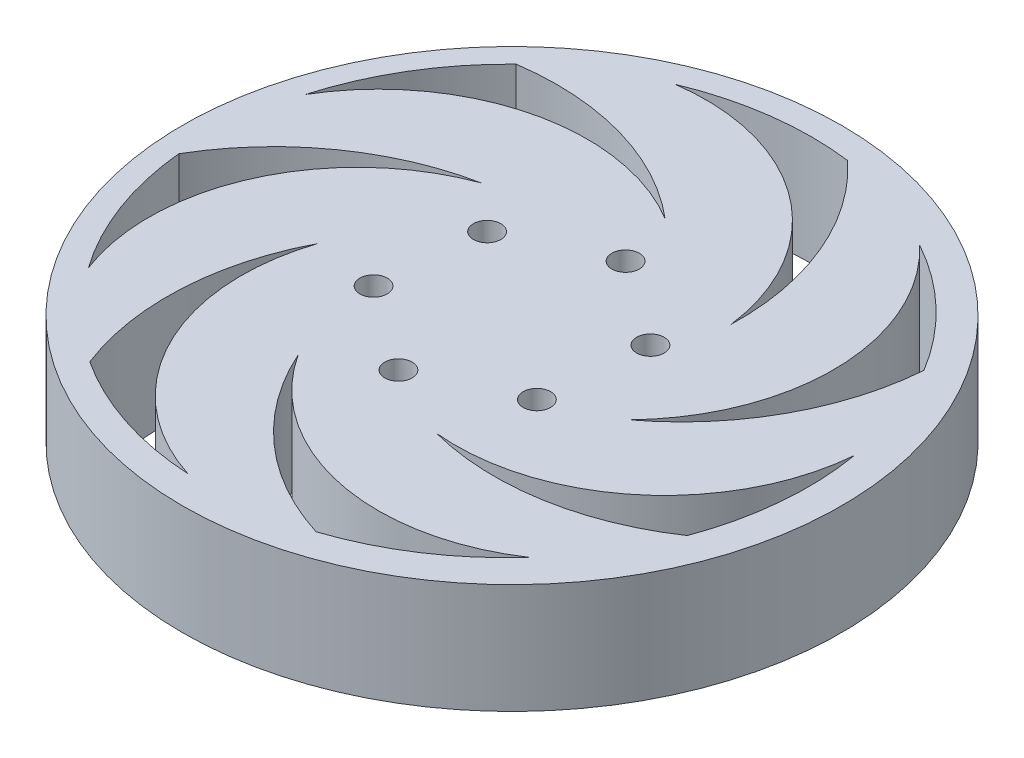
ISO-10303-21;
HEADER;
FILE_DESCRIPTION(('STEP AP214'),'2;1');
FILE_NAME('part.step','',(''),(''),'','','');
FILE_SCHEMA(('AUTOMOTIVE_DESIGN { 1 0 10303 214 1 1 1 1 }'));
ENDSEC;
DATA;
#1=APPLICATION_CONTEXT('core data for automotive mechanical design processes');
#2=APPLICATION_PROTOCOL_DEFINITION('international standard','automotive_design',2000,#1);
#3=PRODUCT_CONTEXT('',#1,'mechanical');
#4=PRODUCT('Part','Part','',(#3));
#5=PRODUCT_RELATED_PRODUCT_CATEGORY('part','',(#4));
#6=PRODUCT_DEFINITION_FORMATION('','',#4);
#7=PRODUCT_DEFINITION_CONTEXT('part definition',#1,'design');
#8=PRODUCT_DEFINITION('design','',#6,#7);
#9=PRODUCT_DEFINITION_SHAPE('','',#8);
#10=(LENGTH_UNIT() NAMED_UNIT(*) SI_UNIT(.MILLI.,.METRE.));
#11=(NAMED_UNIT(*) PLANE_ANGLE_UNIT() SI_UNIT($,.RADIAN.));
#12=(NAMED_UNIT(*) SI_UNIT($,.STERADIAN.) SOLID_ANGLE_UNIT());
#13=UNCERTAINTY_MEASURE_WITH_UNIT(LENGTH_MEASURE(1.E-05),#10,'distance_accuracy_value','');
#14=(GEOMETRIC_REPRESENTATION_CONTEXT(3) GLOBAL_UNCERTAINTY_ASSIGNED_CONTEXT((#13)) GLOBAL_UNIT_ASSIGNED_CONTEXT((#10,
#11,#12)) REPRESENTATION_CONTEXT('',''));
#15=CARTESIAN_POINT('',(0.,0.,0.));
#16=DIRECTION('',(0.,0.,1.));
#17=DIRECTION('',(1.,0.,0.));
#18=AXIS2_PLACEMENT_3D('',#15,#16,#17);
#19=CARTESIAN_POINT('',(0.,10.,0.));
#20=DIRECTION('',(0.,1.,0.));
#21=DIRECTION('',(0.,0.,1.));
#22=AXIS2_PLACEMENT_3D('',#19,#20,#21);
#23=PLANE('',#22);
#24=CARTESIAN_POINT('',(-8.63037772245772,10.,3.97071534710085));
#25=DIRECTION('',(0.,1.,0.));
#26=DIRECTION('',(0.,0.,1.));
#27=AXIS2_PLACEMENT_3D('',#24,#25,#26);
#28=CIRCLE('',#27,1.25000000000002);
#29=CARTESIAN_POINT('',(-8.63037772245772,10.,5.22071534710087));
#30=VERTEX_POINT('',#29);
#31=EDGE_CURVE('E449',#30,#30,#28,.T.);
#32=ORIENTED_EDGE('',*,*,#31,.F.);
#33=EDGE_LOOP('',(#32));
#34=FACE_BOUND('',#33,.T.);
#35=CARTESIAN_POINT('',(0.876448499442818,10.,-9.45948402545444));
#36=DIRECTION('',(0.,1.,0.));
#37=DIRECTION('',(0.,0.,1.));
#38=AXIS2_PLACEMENT_3D('',#35,#36,#37);
#39=CIRCLE('',#38,1.25);
#40=CARTESIAN_POINT('',(0.876448499442818,10.,-8.20948402545444));
#41=VERTEX_POINT('',#40);
#42=EDGE_CURVE('E441',#41,#41,#39,.T.);
#43=ORIENTED_EDGE('',*,*,#42,.F.);
#44=EDGE_LOOP('',(#43));
#45=FACE_BOUND('',#44,.T.);
#46=CARTESIAN_POINT('',(8.63037772245795,10.,-3.97071534710117));
#47=DIRECTION('',(0.,1.,0.));
#48=DIRECTION('',(0.,0.,1.));
#49=AXIS2_PLACEMENT_3D('',#46,#47,#48);
#50=CIRCLE('',#49,1.25);
#51=CARTESIAN_POINT('',(8.63037772245795,10.,-2.72071534710117));
#52=VERTEX_POINT('',#51);
#53=EDGE_CURVE('E433',#52,#52,#50,.T.);
#54=ORIENTED_EDGE('',*,*,#53,.F.);
#55=EDGE_LOOP('',(#54));
#56=FACE_BOUND('',#55,.T.);
#57=CARTESIAN_POINT('',(7.75392922301525,10.,5.48876867835311));
#58=DIRECTION('',(0.,1.,0.));
#59=DIRECTION('',(0.,0.,1.));
#60=AXIS2_PLACEMENT_3D('',#57,#58,#59);
#61=CIRCLE('',#60,1.25);
#62=CARTESIAN_POINT('',(7.75392922301525,10.,6.7387686783531));
#63=VERTEX_POINT('',#62);
#64=EDGE_CURVE('E424',#63,#63,#61,.T.);
#65=ORIENTED_EDGE('',*,*,#64,.F.);
#66=EDGE_LOOP('',(#65));
#67=FACE_BOUND('',#66,.T.);
#68=CARTESIAN_POINT('',(-0.876448499442583,10.,9.45948402545411));
#69=DIRECTION('',(0.,1.,0.));
#70=DIRECTION('',(0.,0.,1.));
#71=AXIS2_PLACEMENT_3D('',#68,#69,#70);
#72=CIRCLE('',#71,1.25);
#73=CARTESIAN_POINT('',(-0.876448499442583,10.,10.7094840254541));
#74=VERTEX_POINT('',#73);
#75=EDGE_CURVE('E423',#74,#74,#72,.T.);
#76=ORIENTED_EDGE('',*,*,#75,.F.);
#77=EDGE_LOOP('',(#76));
#78=FACE_BOUND('',#77,.T.);
#79=CARTESIAN_POINT('',(-7.75392922301502,10.,-5.48876867835344));
#80=DIRECTION('',(0.,1.,0.));
#81=DIRECTION('',(0.,0.,1.));
#82=AXIS2_PLACEMENT_3D('',#79,#80,#81);
#83=CIRCLE('',#82,1.25);
#84=CARTESIAN_POINT('',(-7.75392922301502,10.,-4.23876867835344));
#85=VERTEX_POINT('',#84);
#86=EDGE_CURVE('E428',#85,#85,#83,.T.);
#87=ORIENTED_EDGE('',*,*,#86,.F.);
#88=EDGE_LOOP('',(#87));
#89=FACE_BOUND('',#88,.T.);
#90=CARTESIAN_POINT('',(0.,10.,0.));
#91=DIRECTION('',(0.,1.,0.));
#92=DIRECTION('',(0.,0.,1.));
#93=AXIS2_PLACEMENT_3D('',#90,#91,#92);
#94=CIRCLE('',#93,30.);
#95=CARTESIAN_POINT('',(0.,10.,30.));
#96=VERTEX_POINT('',#95);
#97=EDGE_CURVE('E11',#96,#96,#94,.T.);
#98=ORIENTED_EDGE('',*,*,#97,.T.);
#99=EDGE_LOOP('',(#98));
#100=FACE_BOUND('',#99,.T.);
#101=CARTESIAN_POINT('',(0.,10.,0.));
#102=DIRECTION('',(0.,1.,0.));
#103=DIRECTION('',(0.,0.,1.));
#104=AXIS2_PLACEMENT_3D('',#101,#102,#103);
#105=CIRCLE('',#104,27.);
#106=CARTESIAN_POINT('',(25.3240627069362,10.,9.36439255986001));
#107=VERTEX_POINT('',#106);
#108=CARTESIAN_POINT('',(26.6134779111669,10.,-4.55222950561939));
#109=VERTEX_POINT('',#108);
#110=EDGE_CURVE('E402',#107,#109,#105,.T.);
#111=ORIENTED_EDGE('',*,*,#110,.F.);
#112=CARTESIAN_POINT('',(11.8750939685419,10.,-10.5133648557463));
#113=DIRECTION('',(0.,1.,0.));
#114=DIRECTION('',(0.,0.,1.));
#115=AXIS2_PLACEMENT_3D('',#112,#113,#114);
#116=CIRCLE('',#115,24.);
#117=CARTESIAN_POINT('',(5.85158051151755,10.,12.7184513804641));
#118=VERTEX_POINT('',#117);
#119=EDGE_CURVE('E379',#107,#118,#116,.F.);
#120=ORIENTED_EDGE('',*,*,#119,.T.);
#121=CARTESIAN_POINT('',(7.68445044317262,10.,-6.1929364008077));
#122=DIRECTION('',(0.,1.,0.));
#123=DIRECTION('',(0.,0.,1.));
#124=AXIS2_PLACEMENT_3D('',#121,#122,#123);
#125=CIRCLE('',#124,19.);
#126=EDGE_CURVE('E390',#109,#118,#125,.F.);
#127=ORIENTED_EDGE('',*,*,#126,.F.);
#128=EDGE_LOOP('',(#111,#120,#127));
#129=FACE_BOUND('',#128,.T.);
#130=CARTESIAN_POINT('',(-0.0408638305729063,10.,-0.468279757238414));
#131=DIRECTION('',(0.,1.,0.));
#132=DIRECTION('',(0.781831482468031,0.,0.623489801858732));
#133=AXIS2_PLACEMENT_3D('',#130,#131,#132);
#134=CIRCLE('',#133,27.);
#135=CARTESIAN_POINT('',(23.0698079263208,10.,-14.4288259838412));
#136=VERTEX_POINT('',#135);
#137=CARTESIAN_POINT('',(12.9932918961192,10.,-24.1138033186303));
#138=VERTEX_POINT('',#137);
#139=EDGE_CURVE('E369',#136,#138,#134,.T.);
#140=ORIENTED_EDGE('',*,*,#139,.F.);
#141=CARTESIAN_POINT('',(-0.856543475968335,10.,-16.3075778498885));
#142=DIRECTION('',(0.,1.,0.));
#143=DIRECTION('',(0.781831482468031,0.,0.623489801858732));
#144=AXIS2_PLACEMENT_3D('',#141,#142,#143);
#145=CIRCLE('',#144,24.);
#146=CARTESIAN_POINT('',(13.5512226405994,10.,2.88659510781623));
#147=VERTEX_POINT('',#146);
#148=EDGE_CURVE('E346',#136,#147,#145,.F.);
#149=ORIENTED_EDGE('',*,*,#148,.T.);
#150=CARTESIAN_POINT('',(-0.0915199934396815,10.,-10.3374577286395));
#151=DIRECTION('',(0.,1.,0.));
#152=DIRECTION('',(0.781831482468031,0.,0.623489801858732));
#153=AXIS2_PLACEMENT_3D('',#150,#151,#152);
#154=CIRCLE('',#153,19.);
#155=EDGE_CURVE('E357',#138,#147,#154,.F.);
#156=ORIENTED_EDGE('',*,*,#155,.F.);
#157=EDGE_LOOP('',(#140,#149,#156));
#158=FACE_BOUND('',#157,.T.);
#159=CARTESIAN_POINT('',(-0.340637675184382,10.,0.323916282291169));
#160=DIRECTION('',(0.,1.,0.));
#161=DIRECTION('',(-0.781831482468022,0.,0.623489801858743));
#162=AXIS2_PLACEMENT_3D('',#159,#160,#161);
#163=CIRCLE('',#162,27.);
#164=CARTESIAN_POINT('',(8.12728024673381,10.,25.9616690322429));
#165=VERTEX_POINT('',#164);
#166=CARTESIAN_POINT('',(19.8116707373342,10.,18.2929024987346));
#167=VERTEX_POINT('',#166);
#168=EDGE_CURVE('E212',#165,#167,#163,.T.);
#169=ORIENTED_EDGE('',*,*,#168,.F.);
#170=CARTESIAN_POINT('',(15.2830419412111,10.,3.0532628333854));
#171=DIRECTION('',(0.,1.,0.));
#172=DIRECTION('',(-0.781831482468022,0.,0.623489801858743));
#173=AXIS2_PLACEMENT_3D('',#170,#171,#172);
#174=CIRCLE('',#173,24.);
#175=CARTESIAN_POINT('',(-6.6359225989835,10.,12.8286908795475));
#176=VERTEX_POINT('',#175);
#177=EDGE_CURVE('E189',#165,#176,#174,.F.);
#178=ORIENTED_EDGE('',*,*,#177,.T.);
#179=CARTESIAN_POINT('',(9.29237145609631,10.,2.47062887476548));
#180=DIRECTION('',(0.,1.,0.));
#181=DIRECTION('',(-0.781831482468022,0.,0.623489801858743));
#182=AXIS2_PLACEMENT_3D('',#179,#180,#181);
#183=CIRCLE('',#182,19.);
#184=EDGE_CURVE('E208',#167,#176,#183,.F.);
#185=ORIENTED_EDGE('',*,*,#184,.F.);
#186=EDGE_LOOP('',(#169,#178,#185));
#187=FACE_BOUND('',#186,.T.);
#188=CARTESIAN_POINT('',(-0.879903817308818,10.,-0.584257443099585));
#189=DIRECTION('',(0.,1.,0.));
#190=DIRECTION('',(0.433883739117553,0.,-0.900968867902422));
#191=AXIS2_PLACEMENT_3D('',#188,#189,#190);
#192=CIRCLE('',#191,27.);
#193=CARTESIAN_POINT('',(-19.6330382666304,10.,-20.0089826232834));
#194=VERTEX_POINT('',#193);
#195=CARTESIAN_POINT('',(-26.8329572410984,10.,-8.02999568600916));
#196=VERTEX_POINT('',#195);
#197=EDGE_CURVE('E303',#194,#196,#192,.T.);
#198=ORIENTED_EDGE('',*,*,#197,.F.);
#199=CARTESIAN_POINT('',(-16.1405718406991,10.,3.73554681538402));
#200=DIRECTION('',(0.,1.,0.));
#201=DIRECTION('',(0.433883739117553,0.,-0.900968867902422));
#202=AXIS2_PLACEMENT_3D('',#199,#200,#201);
#203=CIRCLE('',#202,24.);
#204=CARTESIAN_POINT('',(-0.633666445470114,10.,-14.5820918169129));
#205=VERTEX_POINT('',#204);
#206=EDGE_CURVE('E281',#194,#205,#203,.F.);
#207=ORIENTED_EDGE('',*,*,#206,.T.);
#208=CARTESIAN_POINT('',(-10.490368835246,10.,1.66122736358056));
#209=DIRECTION('',(0.,1.,0.));
#210=DIRECTION('',(0.433883739117553,0.,-0.900968867902422));
#211=AXIS2_PLACEMENT_3D('',#208,#209,#210);
#212=CIRCLE('',#211,19.);
#213=EDGE_CURVE('E291',#196,#205,#212,.F.);
#214=ORIENTED_EDGE('',*,*,#213,.F.);
#215=EDGE_LOOP('',(#198,#207,#214));
#216=FACE_BOUND('',#215,.T.);
#217=CARTESIAN_POINT('',(-0.432457869011476,10.,-0.728298781057311));
#218=DIRECTION('',(0.,1.,0.));
#219=DIRECTION('',(0.974927912181823,0.,-0.222520933956318));
#220=AXIS2_PLACEMENT_3D('',#217,#218,#219);
#221=CIRCLE('',#220,27.);
#222=CARTESIAN_POINT('',(3.06201573310802,10.,-27.5012077422459));
#223=VERTEX_POINT('',#222);
#224=CARTESIAN_POINT('',(-10.7926094373162,10.,-25.6615548757144));
#225=VERTEX_POINT('',#224);
#226=EDGE_CURVE('E336',#223,#225,#221,.T.);
#227=ORIENTED_EDGE('',*,*,#226,.F.);
#228=CARTESIAN_POINT('',(-13.3246877185289,10.,-9.9662155840466));
#229=DIRECTION('',(0.,1.,0.));
#230=DIRECTION('',(0.974927912181823,0.,-0.222520933956318));
#231=AXIS2_PLACEMENT_3D('',#228,#229,#230);
#232=CIRCLE('',#231,24.);
#233=CARTESIAN_POINT('',(10.6650162209869,10.,-9.26328963177384));
#234=VERTEX_POINT('',#233);
#235=EDGE_CURVE('E313',#223,#234,#232,.F.);
#236=ORIENTED_EDGE('',*,*,#235,.T.);
#237=CARTESIAN_POINT('',(-8.18007551408156,10.,-6.84202601604447));
#238=DIRECTION('',(0.,1.,0.));
#239=DIRECTION('',(0.974927912181823,0.,-0.222520933956318));
#240=AXIS2_PLACEMENT_3D('',#237,#238,#239);
#241=CIRCLE('',#240,19.);
#242=EDGE_CURVE('E324',#225,#234,#241,.F.);
#243=ORIENTED_EDGE('',*,*,#242,.F.);
#244=EDGE_LOOP('',(#227,#236,#243));
#245=FACE_BOUND('',#244,.T.);
#246=CARTESIAN_POINT('',(-0.806269738969957,10.,0.259553522381841));
#247=DIRECTION('',(0.,1.,0.));
#248=DIRECTION('',(-0.974927912181826,0.,-0.222520933956305));
#249=AXIS2_PLACEMENT_3D('',#246,#247,#248);
#250=CIRCLE('',#249,27.);
#251=CARTESIAN_POINT('',(-15.5710115113208,10.,22.8649157268633));
#252=VERTEX_POINT('',#251);
#253=CARTESIAN_POINT('',(-2.29023009190229,10.,27.2187423393868));
#254=VERTEX_POINT('',#253);
#255=EDGE_CURVE('E241',#252,#254,#250,.T.);
#256=ORIENTED_EDGE('',*,*,#255,.F.);
#257=CARTESIAN_POINT('',(6.80104610914974,10.,14.1763578588194));
#258=DIRECTION('',(0.,1.,0.));
#259=DIRECTION('',(-0.974927912181826,0.,-0.222520933956305));
#260=AXIS2_PLACEMENT_3D('',#257,#258,#259);
#261=CIRCLE('',#260,24.);
#262=CARTESIAN_POINT('',(-14.5079421500552,10.,3.13430101378079));
#263=VERTEX_POINT('',#262);
#264=EDGE_CURVE('E63',#252,#263,#261,.F.);
#265=ORIENTED_EDGE('',*,*,#264,.T.);
#266=CARTESIAN_POINT('',(3.52144572698861,10.,9.12939674104856));
#267=DIRECTION('',(0.,1.,0.));
#268=DIRECTION('',(-0.974927912181826,0.,-0.222520933956305));
#269=AXIS2_PLACEMENT_3D('',#266,#267,#268);
#270=CIRCLE('',#269,19.);
#271=EDGE_CURVE('E230',#254,#263,#270,.F.);
#272=ORIENTED_EDGE('',*,*,#271,.F.);
#273=EDGE_LOOP('',(#256,#265,#272));
#274=FACE_BOUND('',#273,.T.);
#275=CARTESIAN_POINT('',(-1.04626575016305,10.,-0.144621808755232));
#276=DIRECTION('',(0.,1.,0.));
#277=DIRECTION('',(-0.433883739117565,0.,-0.900968867902416));
#278=AXIS2_PLACEMENT_3D('',#275,#276,#277);
#279=CIRCLE('',#278,27.);
#280=CARTESIAN_POINT('',(-27.9255155163579,10.,2.40605104492707));
#281=VERTEX_POINT('',#280);
#282=CARTESIAN_POINT('',(-23.0490424555136,10.,15.5039505623745));
#283=VERTEX_POINT('',#282);
#284=EDGE_CURVE('E271',#281,#283,#279,.T.);
#285=ORIENTED_EDGE('',*,*,#284,.F.);
#286=CARTESIAN_POINT('',(-7.18377766491662,10.,14.4800027966149));
#287=DIRECTION('',(0.,1.,0.));
#288=DIRECTION('',(-0.433883739117565,0.,-0.900968867902416));
#289=AXIS2_PLACEMENT_3D('',#286,#287,#288);
#290=CIRCLE('',#289,24.);
#291=CARTESIAN_POINT('',(-11.8366868598056,10.,-9.06464491839914));
#292=VERTEX_POINT('',#291);
#293=EDGE_CURVE('E55',#281,#292,#290,.F.);
#294=ORIENTED_EDGE('',*,*,#293,.T.);
#295=CARTESIAN_POINT('',(-5.28270196470079,10.,8.76917918061951));
#296=DIRECTION('',(0.,1.,0.));
#297=DIRECTION('',(-0.433883739117565,0.,-0.900968867902416));
#298=AXIS2_PLACEMENT_3D('',#295,#296,#297);
#299=CIRCLE('',#298,19.);
#300=EDGE_CURVE('E260',#283,#292,#299,.F.);
#301=ORIENTED_EDGE('',*,*,#300,.F.);
#302=EDGE_LOOP('',(#285,#294,#301));
#303=FACE_BOUND('',#302,.T.);
#304=ADVANCED_FACE('F39',(#34,#45,#56,#67,#78,#89,#100,#129,#158,#187,#216,#245,#274,#303),#23,.T.);
#305=CARTESIAN_POINT('',(0.,0.,0.));
#306=DIRECTION('',(0.,1.,0.));
#307=DIRECTION('',(0.,0.,1.));
#308=AXIS2_PLACEMENT_3D('',#305,#306,#307);
#309=PLANE('',#308);
#310=CARTESIAN_POINT('',(6.80104610914974,0.,14.1763578588194));
#311=DIRECTION('',(0.,1.,0.));
#312=DIRECTION('',(-0.974927912181826,0.,-0.222520933956305));
#313=AXIS2_PLACEMENT_3D('',#310,#311,#312);
#314=CIRCLE('',#313,24.);
#315=CARTESIAN_POINT('',(-15.5710115113208,0.,22.8649157268633));
#316=VERTEX_POINT('',#315);
#317=CARTESIAN_POINT('',(-14.5079421500552,0.,3.13430101378079));
#318=VERTEX_POINT('',#317);
#319=EDGE_CURVE('E226',#316,#318,#314,.F.);
#320=ORIENTED_EDGE('',*,*,#319,.F.);
#321=CARTESIAN_POINT('',(-0.806269738969957,0.,0.259553522381841));
#322=DIRECTION('',(0.,1.,0.));
#323=DIRECTION('',(-0.974927912181826,0.,-0.222520933956305));
#324=AXIS2_PLACEMENT_3D('',#321,#322,#323);
#325=CIRCLE('',#324,27.);
#326=CARTESIAN_POINT('',(-2.29023009190229,0.,27.2187423393868));
#327=VERTEX_POINT('',#326);
#328=EDGE_CURVE('E229',#316,#327,#325,.T.);
#329=ORIENTED_EDGE('',*,*,#328,.T.);
#330=CARTESIAN_POINT('',(3.52144572698861,0.,9.12939674104856));
#331=DIRECTION('',(0.,1.,0.));
#332=DIRECTION('',(-0.974927912181826,0.,-0.222520933956305));
#333=AXIS2_PLACEMENT_3D('',#330,#331,#332);
#334=CIRCLE('',#333,19.);
#335=EDGE_CURVE('E234',#327,#318,#334,.F.);
#336=ORIENTED_EDGE('',*,*,#335,.T.);
#337=EDGE_LOOP('',(#320,#329,#336));
#338=FACE_BOUND('',#337,.T.);
#339=CARTESIAN_POINT('',(-16.1405718406991,0.,3.73554681538402));
#340=DIRECTION('',(0.,1.,0.));
#341=DIRECTION('',(0.433883739117553,0.,-0.900968867902422));
#342=AXIS2_PLACEMENT_3D('',#339,#340,#341);
#343=CIRCLE('',#342,24.);
#344=CARTESIAN_POINT('',(-19.6330382666304,0.,-20.0089826232834));
#345=VERTEX_POINT('',#344);
#346=CARTESIAN_POINT('',(-0.633666445470114,0.,-14.5820918169129));
#347=VERTEX_POINT('',#346);
#348=EDGE_CURVE('E287',#345,#347,#343,.F.);
#349=ORIENTED_EDGE('',*,*,#348,.F.);
#350=CARTESIAN_POINT('',(-0.879903817308818,0.,-0.584257443099585));
#351=DIRECTION('',(0.,1.,0.));
#352=DIRECTION('',(0.433883739117553,0.,-0.900968867902422));
#353=AXIS2_PLACEMENT_3D('',#350,#351,#352);
#354=CIRCLE('',#353,27.);
#355=CARTESIAN_POINT('',(-26.8329572410984,0.,-8.02999568600916));
#356=VERTEX_POINT('',#355);
#357=EDGE_CURVE('E290',#345,#356,#354,.T.);
#358=ORIENTED_EDGE('',*,*,#357,.T.);
#359=CARTESIAN_POINT('',(-10.490368835246,0.,1.66122736358056));
#360=DIRECTION('',(0.,1.,0.));
#361=DIRECTION('',(0.433883739117553,0.,-0.900968867902422));
#362=AXIS2_PLACEMENT_3D('',#359,#360,#361);
#363=CIRCLE('',#362,19.);
#364=EDGE_CURVE('E295',#356,#347,#363,.F.);
#365=ORIENTED_EDGE('',*,*,#364,.T.);
#366=EDGE_LOOP('',(#349,#358,#365));
#367=FACE_BOUND('',#366,.T.);
#368=CARTESIAN_POINT('',(-0.856543475968335,0.,-16.3075778498885));
#369=DIRECTION('',(0.,1.,0.));
#370=DIRECTION('',(0.781831482468031,0.,0.623489801858732));
#371=AXIS2_PLACEMENT_3D('',#368,#369,#370);
#372=CIRCLE('',#371,24.);
#373=CARTESIAN_POINT('',(23.0698079263208,0.,-14.4288259838412));
#374=VERTEX_POINT('',#373);
#375=CARTESIAN_POINT('',(13.5512226405994,0.,2.88659510781623));
#376=VERTEX_POINT('',#375);
#377=EDGE_CURVE('E353',#374,#376,#372,.F.);
#378=ORIENTED_EDGE('',*,*,#377,.F.);
#379=CARTESIAN_POINT('',(-0.0408638305729063,0.,-0.468279757238414));
#380=DIRECTION('',(0.,1.,0.));
#381=DIRECTION('',(0.781831482468031,0.,0.623489801858732));
#382=AXIS2_PLACEMENT_3D('',#379,#380,#381);
#383=CIRCLE('',#382,27.);
#384=CARTESIAN_POINT('',(12.9932918961192,0.,-24.1138033186303));
#385=VERTEX_POINT('',#384);
#386=EDGE_CURVE('E356',#374,#385,#383,.T.);
#387=ORIENTED_EDGE('',*,*,#386,.T.);
#388=CARTESIAN_POINT('',(-0.0915199934396815,0.,-10.3374577286395));
#389=DIRECTION('',(0.,1.,0.));
#390=DIRECTION('',(0.781831482468031,0.,0.623489801858732));
#391=AXIS2_PLACEMENT_3D('',#388,#389,#390);
#392=CIRCLE('',#391,19.);
#393=EDGE_CURVE('E361',#385,#376,#392,.F.);
#394=ORIENTED_EDGE('',*,*,#393,.T.);
#395=EDGE_LOOP('',(#378,#387,#394));
#396=FACE_BOUND('',#395,.T.);
#397=CARTESIAN_POINT('',(0.,0.,0.));
#398=DIRECTION('',(0.,1.,0.));
#399=DIRECTION('',(0.,0.,1.));
#400=AXIS2_PLACEMENT_3D('',#397,#398,#399);
#401=CIRCLE('',#400,30.);
#402=CARTESIAN_POINT('',(0.,0.,30.));
#403=VERTEX_POINT('',#402);
#404=EDGE_CURVE('E43',#403,#403,#401,.T.);
#405=ORIENTED_EDGE('',*,*,#404,.F.);
#406=EDGE_LOOP('',(#405));
#407=FACE_BOUND('',#406,.T.);
#408=CARTESIAN_POINT('',(-7.75392922301502,0.,-5.48876867835344));
#409=DIRECTION('',(0.,1.,0.));
#410=DIRECTION('',(0.,0.,1.));
#411=AXIS2_PLACEMENT_3D('',#408,#409,#410);
#412=CIRCLE('',#411,1.25);
#413=CARTESIAN_POINT('',(-7.75392922301502,0.,-4.23876867835344));
#414=VERTEX_POINT('',#413);
#415=EDGE_CURVE('E462',#414,#414,#412,.F.);
#416=ORIENTED_EDGE('',*,*,#415,.F.);
#417=EDGE_LOOP('',(#416));
#418=FACE_BOUND('',#417,.T.);
#419=CARTESIAN_POINT('',(-0.876448499442583,0.,9.45948402545411));
#420=DIRECTION('',(0.,1.,0.));
#421=DIRECTION('',(0.,0.,1.));
#422=AXIS2_PLACEMENT_3D('',#419,#420,#421);
#423=CIRCLE('',#422,1.25);
#424=CARTESIAN_POINT('',(-0.876448499442583,0.,10.7094840254541));
#425=VERTEX_POINT('',#424);
#426=EDGE_CURVE('E419',#425,#425,#423,.F.);
#427=ORIENTED_EDGE('',*,*,#426,.F.);
#428=EDGE_LOOP('',(#427));
#429=FACE_BOUND('',#428,.T.);
#430=CARTESIAN_POINT('',(7.75392922301525,0.,5.48876867835311));
#431=DIRECTION('',(0.,1.,0.));
#432=DIRECTION('',(0.,0.,1.));
#433=AXIS2_PLACEMENT_3D('',#430,#431,#432);
#434=CIRCLE('',#433,1.25);
#435=CARTESIAN_POINT('',(7.75392922301525,0.,6.7387686783531));
#436=VERTEX_POINT('',#435);
#437=EDGE_CURVE('E429',#436,#436,#434,.F.);
#438=ORIENTED_EDGE('',*,*,#437,.F.);
#439=EDGE_LOOP('',(#438));
#440=FACE_BOUND('',#439,.T.);
#441=CARTESIAN_POINT('',(8.63037772245795,0.,-3.97071534710117));
#442=DIRECTION('',(0.,1.,0.));
#443=DIRECTION('',(0.,0.,1.));
#444=AXIS2_PLACEMENT_3D('',#441,#442,#443);
#445=CIRCLE('',#444,1.25);
#446=CARTESIAN_POINT('',(8.63037772245795,0.,-2.72071534710117));
#447=VERTEX_POINT('',#446);
#448=EDGE_CURVE('E437',#447,#447,#445,.F.);
#449=ORIENTED_EDGE('',*,*,#448,.F.);
#450=EDGE_LOOP('',(#449));
#451=FACE_BOUND('',#450,.T.);
#452=CARTESIAN_POINT('',(0.876448499442818,0.,-9.45948402545444));
#453=DIRECTION('',(0.,1.,0.));
#454=DIRECTION('',(0.,0.,1.));
#455=AXIS2_PLACEMENT_3D('',#452,#453,#454);
#456=CIRCLE('',#455,1.25);
#457=CARTESIAN_POINT('',(0.876448499442818,0.,-8.20948402545444));
#458=VERTEX_POINT('',#457);
#459=EDGE_CURVE('E445',#458,#458,#456,.F.);
#460=ORIENTED_EDGE('',*,*,#459,.F.);
#461=EDGE_LOOP('',(#460));
#462=FACE_BOUND('',#461,.T.);
#463=CARTESIAN_POINT('',(-8.63037772245772,0.,3.97071534710085));
#464=DIRECTION('',(0.,1.,0.));
#465=DIRECTION('',(0.,0.,1.));
#466=AXIS2_PLACEMENT_3D('',#463,#464,#465);
#467=CIRCLE('',#466,1.25000000000002);
#468=CARTESIAN_POINT('',(-8.63037772245772,0.,5.22071534710087));
#469=VERTEX_POINT('',#468);
#470=EDGE_CURVE('E412',#469,#469,#467,.F.);
#471=ORIENTED_EDGE('',*,*,#470,.F.);
#472=EDGE_LOOP('',(#471));
#473=FACE_BOUND('',#472,.T.);
#474=CARTESIAN_POINT('',(11.8750939685419,0.,-10.5133648557463));
#475=DIRECTION('',(0.,1.,0.));
#476=DIRECTION('',(0.,0.,1.));
#477=AXIS2_PLACEMENT_3D('',#474,#475,#476);
#478=CIRCLE('',#477,24.);
#479=CARTESIAN_POINT('',(25.3240627069362,0.,9.36439255986001));
#480=VERTEX_POINT('',#479);
#481=CARTESIAN_POINT('',(5.85158051151755,0.,12.7184513804641));
#482=VERTEX_POINT('',#481);
#483=EDGE_CURVE('E386',#480,#482,#478,.F.);
#484=ORIENTED_EDGE('',*,*,#483,.F.);
#485=CARTESIAN_POINT('',(0.,0.,0.));
#486=DIRECTION('',(0.,1.,0.));
#487=DIRECTION('',(0.,0.,1.));
#488=AXIS2_PLACEMENT_3D('',#485,#486,#487);
#489=CIRCLE('',#488,27.);
#490=CARTESIAN_POINT('',(26.6134779111669,0.,-4.55222950561939));
#491=VERTEX_POINT('',#490);
#492=EDGE_CURVE('E389',#480,#491,#489,.T.);
#493=ORIENTED_EDGE('',*,*,#492,.T.);
#494=CARTESIAN_POINT('',(7.68445044317262,0.,-6.1929364008077));
#495=DIRECTION('',(0.,1.,0.));
#496=DIRECTION('',(0.,0.,1.));
#497=AXIS2_PLACEMENT_3D('',#494,#495,#496);
#498=CIRCLE('',#497,19.);
#499=EDGE_CURVE('E394',#491,#482,#498,.F.);
#500=ORIENTED_EDGE('',*,*,#499,.T.);
#501=EDGE_LOOP('',(#484,#493,#500));
#502=FACE_BOUND('',#501,.T.);
#503=CARTESIAN_POINT('',(15.2830419412111,0.,3.0532628333854));
#504=DIRECTION('',(0.,1.,0.));
#505=DIRECTION('',(-0.781831482468022,0.,0.623489801858743));
#506=AXIS2_PLACEMENT_3D('',#503,#504,#505);
#507=CIRCLE('',#506,24.);
#508=CARTESIAN_POINT('',(8.12728024673381,0.,25.9616690322429));
#509=VERTEX_POINT('',#508);
#510=CARTESIAN_POINT('',(-6.6359225989835,0.,12.8286908795475));
#511=VERTEX_POINT('',#510);
#512=EDGE_CURVE('E186',#509,#511,#507,.F.);
#513=ORIENTED_EDGE('',*,*,#512,.F.);
#514=CARTESIAN_POINT('',(-0.340637675184382,0.,0.323916282291169));
#515=DIRECTION('',(0.,1.,0.));
#516=DIRECTION('',(-0.781831482468022,0.,0.623489801858743));
#517=AXIS2_PLACEMENT_3D('',#514,#515,#516);
#518=CIRCLE('',#517,27.);
#519=CARTESIAN_POINT('',(19.8116707373342,0.,18.2929024987346));
#520=VERTEX_POINT('',#519);
#521=EDGE_CURVE('E199',#509,#520,#518,.T.);
#522=ORIENTED_EDGE('',*,*,#521,.T.);
#523=CARTESIAN_POINT('',(9.29237145609631,0.,2.47062887476548));
#524=DIRECTION('',(0.,1.,0.));
#525=DIRECTION('',(-0.781831482468022,0.,0.623489801858743));
#526=AXIS2_PLACEMENT_3D('',#523,#524,#525);
#527=CIRCLE('',#526,19.);
#528=EDGE_CURVE('E195',#520,#511,#527,.F.);
#529=ORIENTED_EDGE('',*,*,#528,.T.);
#530=EDGE_LOOP('',(#513,#522,#529));
#531=FACE_BOUND('',#530,.T.);
#532=CARTESIAN_POINT('',(-13.3246877185289,0.,-9.9662155840466));
#533=DIRECTION('',(0.,1.,0.));
#534=DIRECTION('',(0.974927912181823,0.,-0.222520933956318));
#535=AXIS2_PLACEMENT_3D('',#532,#533,#534);
#536=CIRCLE('',#535,24.);
#537=CARTESIAN_POINT('',(3.06201573310802,0.,-27.5012077422459));
#538=VERTEX_POINT('',#537);
#539=CARTESIAN_POINT('',(10.6650162209869,0.,-9.26328963177384));
#540=VERTEX_POINT('',#539);
#541=EDGE_CURVE('E320',#538,#540,#536,.F.);
#542=ORIENTED_EDGE('',*,*,#541,.F.);
#543=CARTESIAN_POINT('',(-0.432457869011476,0.,-0.728298781057311));
#544=DIRECTION('',(0.,1.,0.));
#545=DIRECTION('',(0.974927912181823,0.,-0.222520933956318));
#546=AXIS2_PLACEMENT_3D('',#543,#544,#545);
#547=CIRCLE('',#546,27.);
#548=CARTESIAN_POINT('',(-10.7926094373162,0.,-25.6615548757144));
#549=VERTEX_POINT('',#548);
#550=EDGE_CURVE('E323',#538,#549,#547,.T.);
#551=ORIENTED_EDGE('',*,*,#550,.T.);
#552=CARTESIAN_POINT('',(-8.18007551408156,0.,-6.84202601604447));
#553=DIRECTION('',(0.,1.,0.));
#554=DIRECTION('',(0.974927912181823,0.,-0.222520933956318));
#555=AXIS2_PLACEMENT_3D('',#552,#553,#554);
#556=CIRCLE('',#555,19.);
#557=EDGE_CURVE('E328',#549,#540,#556,.F.);
#558=ORIENTED_EDGE('',*,*,#557,.T.);
#559=EDGE_LOOP('',(#542,#551,#558));
#560=FACE_BOUND('',#559,.T.);
#561=CARTESIAN_POINT('',(-7.18377766491662,0.,14.4800027966149));
#562=DIRECTION('',(0.,1.,0.));
#563=DIRECTION('',(-0.433883739117565,0.,-0.900968867902416));
#564=AXIS2_PLACEMENT_3D('',#561,#562,#563);
#565=CIRCLE('',#564,24.);
#566=CARTESIAN_POINT('',(-27.9255155163579,0.,2.40605104492707));
#567=VERTEX_POINT('',#566);
#568=CARTESIAN_POINT('',(-11.8366868598056,0.,-9.06464491839914));
#569=VERTEX_POINT('',#568);
#570=EDGE_CURVE('E256',#567,#569,#565,.F.);
#571=ORIENTED_EDGE('',*,*,#570,.F.);
#572=CARTESIAN_POINT('',(-1.04626575016305,0.,-0.144621808755232));
#573=DIRECTION('',(0.,1.,0.));
#574=DIRECTION('',(-0.433883739117565,0.,-0.900968867902416));
#575=AXIS2_PLACEMENT_3D('',#572,#573,#574);
#576=CIRCLE('',#575,27.);
#577=CARTESIAN_POINT('',(-23.0490424555136,0.,15.5039505623745));
#578=VERTEX_POINT('',#577);
#579=EDGE_CURVE('E259',#567,#578,#576,.T.);
#580=ORIENTED_EDGE('',*,*,#579,.T.);
#581=CARTESIAN_POINT('',(-5.28270196470079,0.,8.76917918061951));
#582=DIRECTION('',(0.,1.,0.));
#583=DIRECTION('',(-0.433883739117565,0.,-0.900968867902416));
#584=AXIS2_PLACEMENT_3D('',#581,#582,#583);
#585=CIRCLE('',#584,19.);
#586=EDGE_CURVE('E264',#578,#569,#585,.F.);
#587=ORIENTED_EDGE('',*,*,#586,.T.);
#588=EDGE_LOOP('',(#571,#580,#587));
#589=FACE_BOUND('',#588,.T.);
#590=ADVANCED_FACE('F205',(#338,#367,#396,#407,#418,#429,#440,#451,#462,#473,#502,#531,#560,
#589),#309,.F.);
#591=CARTESIAN_POINT('',(0.,10.,0.));
#592=DIRECTION('',(0.,-1.,0.));
#593=DIRECTION('',(0.,0.,-1.));
#594=AXIS2_PLACEMENT_3D('',#591,#592,#593);
#595=CYLINDRICAL_SURFACE('',#594,30.);
#596=ORIENTED_EDGE('',*,*,#97,.F.);
#597=EDGE_LOOP('',(#596));
#598=FACE_BOUND('',#597,.T.);
#599=ORIENTED_EDGE('',*,*,#404,.T.);
#600=EDGE_LOOP('',(#599));
#601=FACE_BOUND('',#600,.T.);
#602=ADVANCED_FACE('F41',(#598,#601),#595,.T.);
#603=CARTESIAN_POINT('',(-7.75392922301502,-0.000999999999999265,-5.48876867835344));
#604=DIRECTION('',(0.,1.,0.));
#605=DIRECTION('',(0.,0.,1.));
#606=AXIS2_PLACEMENT_3D('',#603,#604,#605);
#607=CYLINDRICAL_SURFACE('',#606,1.25);
#608=ORIENTED_EDGE('',*,*,#86,.T.);
#609=EDGE_LOOP('',(#608));
#610=FACE_BOUND('',#609,.T.);
#611=ORIENTED_EDGE('',*,*,#415,.T.);
#612=EDGE_LOOP('',(#611));
#613=FACE_BOUND('',#612,.T.);
#614=ADVANCED_FACE('F520',(#610,#613),#607,.F.);
#615=CARTESIAN_POINT('',(-0.876448499442583,-0.000999999999999265,9.45948402545411));
#616=DIRECTION('',(0.,1.,0.));
#617=DIRECTION('',(0.,0.,1.));
#618=AXIS2_PLACEMENT_3D('',#615,#616,#617);
#619=CYLINDRICAL_SURFACE('',#618,1.25);
#620=ORIENTED_EDGE('',*,*,#75,.T.);
#621=EDGE_LOOP('',(#620));
#622=FACE_BOUND('',#621,.T.);
#623=ORIENTED_EDGE('',*,*,#426,.T.);
#624=EDGE_LOOP('',(#623));
#625=FACE_BOUND('',#624,.T.);
#626=ADVANCED_FACE('F523',(#622,#625),#619,.F.);
#627=CARTESIAN_POINT('',(7.75392922301525,-0.000999999999999265,5.48876867835311));
#628=DIRECTION('',(0.,1.,0.));
#629=DIRECTION('',(0.,0.,1.));
#630=AXIS2_PLACEMENT_3D('',#627,#628,#629);
#631=CYLINDRICAL_SURFACE('',#630,1.25);
#632=ORIENTED_EDGE('',*,*,#64,.T.);
#633=EDGE_LOOP('',(#632));
#634=FACE_BOUND('',#633,.T.);
#635=ORIENTED_EDGE('',*,*,#437,.T.);
#636=EDGE_LOOP('',(#635));
#637=FACE_BOUND('',#636,.T.);
#638=ADVANCED_FACE('F536',(#634,#637),#631,.F.);
#639=CARTESIAN_POINT('',(8.63037772245795,-0.000999999999999265,-3.97071534710117));
#640=DIRECTION('',(0.,1.,0.));
#641=DIRECTION('',(0.,0.,1.));
#642=AXIS2_PLACEMENT_3D('',#639,#640,#641);
#643=CYLINDRICAL_SURFACE('',#642,1.25);
#644=ORIENTED_EDGE('',*,*,#53,.T.);
#645=EDGE_LOOP('',(#644));
#646=FACE_BOUND('',#645,.T.);
#647=ORIENTED_EDGE('',*,*,#448,.T.);
#648=EDGE_LOOP('',(#647));
#649=FACE_BOUND('',#648,.T.);
#650=ADVANCED_FACE('F532',(#646,#649),#643,.F.);
#651=CARTESIAN_POINT('',(0.876448499442818,-0.000999999999999265,-9.45948402545444));
#652=DIRECTION('',(0.,1.,0.));
#653=DIRECTION('',(0.,0.,1.));
#654=AXIS2_PLACEMENT_3D('',#651,#652,#653);
#655=CYLINDRICAL_SURFACE('',#654,1.25);
#656=ORIENTED_EDGE('',*,*,#42,.T.);
#657=EDGE_LOOP('',(#656));
#658=FACE_BOUND('',#657,.T.);
#659=ORIENTED_EDGE('',*,*,#459,.T.);
#660=EDGE_LOOP('',(#659));
#661=FACE_BOUND('',#660,.T.);
#662=ADVANCED_FACE('F528',(#658,#661),#655,.F.);
#663=CARTESIAN_POINT('',(-8.63037772245772,-0.000999999999999265,3.97071534710085));
#664=DIRECTION('',(0.,1.,0.));
#665=DIRECTION('',(0.,0.,1.));
#666=AXIS2_PLACEMENT_3D('',#663,#664,#665);
#667=CYLINDRICAL_SURFACE('',#666,1.25000000000002);
#668=ORIENTED_EDGE('',*,*,#31,.T.);
#669=EDGE_LOOP('',(#668));
#670=FACE_BOUND('',#669,.T.);
#671=ORIENTED_EDGE('',*,*,#470,.T.);
#672=EDGE_LOOP('',(#671));
#673=FACE_BOUND('',#672,.T.);
#674=ADVANCED_FACE('F525',(#670,#673),#667,.F.);
#675=CARTESIAN_POINT('',(11.8750939685419,0.,-10.5133648557463));
#676=DIRECTION('',(0.,1.,0.));
#677=DIRECTION('',(0.,0.,1.));
#678=AXIS2_PLACEMENT_3D('',#675,#676,#677);
#679=CYLINDRICAL_SURFACE('',#678,24.);
#680=ORIENTED_EDGE('',*,*,#119,.F.);
#681=DIRECTION('',(0.,1.,0.));
#682=VECTOR('',#681,1.);
#683=CARTESIAN_POINT('',(25.3240627069362,0.,9.36439255986001));
#684=LINE('',#683,#682);
#685=EDGE_CURVE('E398',#480,#107,#684,.T.);
#686=ORIENTED_EDGE('',*,*,#685,.F.);
#687=ORIENTED_EDGE('',*,*,#483,.T.);
#688=DIRECTION('',(0.,1.,0.));
#689=VECTOR('',#688,1.);
#690=CARTESIAN_POINT('',(5.85158051151755,0.,12.7184513804641));
#691=LINE('',#690,#689);
#692=EDGE_CURVE('E409',#482,#118,#691,.T.);
#693=ORIENTED_EDGE('',*,*,#692,.T.);
#694=EDGE_LOOP('',(#680,#686,#687,#693));
#695=FACE_BOUND('',#694,.T.);
#696=ADVANCED_FACE('F490',(#695),#679,.F.);
#697=CARTESIAN_POINT('',(7.68445044317262,0.,-6.1929364008077));
#698=DIRECTION('',(0.,1.,0.));
#699=DIRECTION('',(0.,0.,1.));
#700=AXIS2_PLACEMENT_3D('',#697,#698,#699);
#701=CYLINDRICAL_SURFACE('',#700,19.);
#702=ORIENTED_EDGE('',*,*,#126,.T.);
#703=ORIENTED_EDGE('',*,*,#692,.F.);
#704=ORIENTED_EDGE('',*,*,#499,.F.);
#705=DIRECTION('',(0.,1.,0.));
#706=VECTOR('',#705,1.);
#707=CARTESIAN_POINT('',(26.6134779111669,0.,-4.55222950561939));
#708=LINE('',#707,#706);
#709=EDGE_CURVE('E413',#491,#109,#708,.T.);
#710=ORIENTED_EDGE('',*,*,#709,.T.);
#711=EDGE_LOOP('',(#702,#703,#704,#710));
#712=FACE_BOUND('',#711,.T.);
#713=ADVANCED_FACE('F492',(#712),#701,.T.);
#714=CARTESIAN_POINT('',(0.,0.,0.));
#715=DIRECTION('',(0.,1.,0.));
#716=DIRECTION('',(0.,0.,1.));
#717=AXIS2_PLACEMENT_3D('',#714,#715,#716);
#718=CYLINDRICAL_SURFACE('',#717,27.);
#719=ORIENTED_EDGE('',*,*,#110,.T.);
#720=ORIENTED_EDGE('',*,*,#709,.F.);
#721=ORIENTED_EDGE('',*,*,#492,.F.);
#722=ORIENTED_EDGE('',*,*,#685,.T.);
#723=EDGE_LOOP('',(#719,#720,#721,#722));
#724=FACE_BOUND('',#723,.T.);
#725=ADVANCED_FACE('F499',(#724),#718,.F.);
#726=CARTESIAN_POINT('',(-0.856543475968335,0.,-16.3075778498885));
#727=DIRECTION('',(0.,1.,0.));
#728=DIRECTION('',(0.,0.,1.));
#729=AXIS2_PLACEMENT_3D('',#726,#727,#728);
#730=CYLINDRICAL_SURFACE('',#729,24.);
#731=ORIENTED_EDGE('',*,*,#148,.F.);
#732=DIRECTION('',(0.,1.,0.));
#733=VECTOR('',#732,1.);
#734=CARTESIAN_POINT('',(23.0698079263208,0.,-14.4288259838412));
#735=LINE('',#734,#733);
#736=EDGE_CURVE('E365',#374,#136,#735,.T.);
#737=ORIENTED_EDGE('',*,*,#736,.F.);
#738=ORIENTED_EDGE('',*,*,#377,.T.);
#739=DIRECTION('',(0.,1.,0.));
#740=VECTOR('',#739,1.);
#741=CARTESIAN_POINT('',(13.5512226405994,0.,2.88659510781623));
#742=LINE('',#741,#740);
#743=EDGE_CURVE('E376',#376,#147,#742,.T.);
#744=ORIENTED_EDGE('',*,*,#743,.T.);
#745=EDGE_LOOP('',(#731,#737,#738,#744));
#746=FACE_BOUND('',#745,.T.);
#747=ADVANCED_FACE('F501',(#746),#730,.F.);
#748=CARTESIAN_POINT('',(-0.0915199934396815,0.,-10.3374577286395));
#749=DIRECTION('',(0.,1.,0.));
#750=DIRECTION('',(0.,0.,1.));
#751=AXIS2_PLACEMENT_3D('',#748,#749,#750);
#752=CYLINDRICAL_SURFACE('',#751,19.);
#753=ORIENTED_EDGE('',*,*,#155,.T.);
#754=ORIENTED_EDGE('',*,*,#743,.F.);
#755=ORIENTED_EDGE('',*,*,#393,.F.);
#756=DIRECTION('',(0.,1.,0.));
#757=VECTOR('',#756,1.);
#758=CARTESIAN_POINT('',(12.9932918961192,0.,-24.1138033186303));
#759=LINE('',#758,#757);
#760=EDGE_CURVE('E380',#385,#138,#759,.T.);
#761=ORIENTED_EDGE('',*,*,#760,.T.);
#762=EDGE_LOOP('',(#753,#754,#755,#761));
#763=FACE_BOUND('',#762,.T.);
#764=ADVANCED_FACE('F507',(#763),#752,.T.);
#765=CARTESIAN_POINT('',(-0.0408638305729063,0.,-0.468279757238414));
#766=DIRECTION('',(0.,1.,0.));
#767=DIRECTION('',(0.,0.,1.));
#768=AXIS2_PLACEMENT_3D('',#765,#766,#767);
#769=CYLINDRICAL_SURFACE('',#768,27.);
#770=ORIENTED_EDGE('',*,*,#139,.T.);
#771=ORIENTED_EDGE('',*,*,#760,.F.);
#772=ORIENTED_EDGE('',*,*,#386,.F.);
#773=ORIENTED_EDGE('',*,*,#736,.T.);
#774=EDGE_LOOP('',(#770,#771,#772,#773));
#775=FACE_BOUND('',#774,.T.);
#776=ADVANCED_FACE('F582',(#775),#769,.F.);
#777=CARTESIAN_POINT('',(15.2830419412111,0.,3.0532628333854));
#778=DIRECTION('',(0.,1.,0.));
#779=DIRECTION('',(0.,0.,1.));
#780=AXIS2_PLACEMENT_3D('',#777,#778,#779);
#781=CYLINDRICAL_SURFACE('',#780,24.);
#782=ORIENTED_EDGE('',*,*,#177,.F.);
#783=DIRECTION('',(0.,1.,0.));
#784=VECTOR('',#783,1.);
#785=CARTESIAN_POINT('',(8.12728024673381,0.,25.9616690322429));
#786=LINE('',#785,#784);
#787=EDGE_CURVE('E182',#509,#165,#786,.T.);
#788=ORIENTED_EDGE('',*,*,#787,.F.);
#789=ORIENTED_EDGE('',*,*,#512,.T.);
#790=DIRECTION('',(0.,1.,0.));
#791=VECTOR('',#790,1.);
#792=CARTESIAN_POINT('',(-6.6359225989835,0.,12.8286908795475));
#793=LINE('',#792,#791);
#794=EDGE_CURVE('E221',#511,#176,#793,.T.);
#795=ORIENTED_EDGE('',*,*,#794,.T.);
#796=EDGE_LOOP('',(#782,#788,#789,#795));
#797=FACE_BOUND('',#796,.T.);
#798=ADVANCED_FACE('F184',(#797),#781,.F.);
#799=CARTESIAN_POINT('',(9.29237145609631,0.,2.47062887476548));
#800=DIRECTION('',(0.,1.,0.));
#801=DIRECTION('',(0.,0.,1.));
#802=AXIS2_PLACEMENT_3D('',#799,#800,#801);
#803=CYLINDRICAL_SURFACE('',#802,19.);
#804=ORIENTED_EDGE('',*,*,#184,.T.);
#805=ORIENTED_EDGE('',*,*,#794,.F.);
#806=ORIENTED_EDGE('',*,*,#528,.F.);
#807=DIRECTION('',(0.,1.,0.));
#808=VECTOR('',#807,1.);
#809=CARTESIAN_POINT('',(19.8116707373342,0.,18.2929024987346));
#810=LINE('',#809,#808);
#811=EDGE_CURVE('E194',#520,#167,#810,.T.);
#812=ORIENTED_EDGE('',*,*,#811,.T.);
#813=EDGE_LOOP('',(#804,#805,#806,#812));
#814=FACE_BOUND('',#813,.T.);
#815=ADVANCED_FACE('F601',(#814),#803,.T.);
#816=CARTESIAN_POINT('',(-0.340637675184382,0.,0.323916282291169));
#817=DIRECTION('',(0.,1.,0.));
#818=DIRECTION('',(0.,0.,1.));
#819=AXIS2_PLACEMENT_3D('',#816,#817,#818);
#820=CYLINDRICAL_SURFACE('',#819,27.);
#821=ORIENTED_EDGE('',*,*,#168,.T.);
#822=ORIENTED_EDGE('',*,*,#811,.F.);
#823=ORIENTED_EDGE('',*,*,#521,.F.);
#824=ORIENTED_EDGE('',*,*,#787,.T.);
#825=EDGE_LOOP('',(#821,#822,#823,#824));
#826=FACE_BOUND('',#825,.T.);
#827=ADVANCED_FACE('F200',(#826),#820,.F.);
#828=CARTESIAN_POINT('',(-16.1405718406991,0.,3.73554681538402));
#829=DIRECTION('',(0.,1.,0.));
#830=DIRECTION('',(0.,0.,1.));
#831=AXIS2_PLACEMENT_3D('',#828,#829,#830);
#832=CYLINDRICAL_SURFACE('',#831,24.);
#833=ORIENTED_EDGE('',*,*,#206,.F.);
#834=DIRECTION('',(0.,1.,0.));
#835=VECTOR('',#834,1.);
#836=CARTESIAN_POINT('',(-19.6330382666304,0.,-20.0089826232834));
#837=LINE('',#836,#835);
#838=EDGE_CURVE('E299',#345,#194,#837,.T.);
#839=ORIENTED_EDGE('',*,*,#838,.F.);
#840=ORIENTED_EDGE('',*,*,#348,.T.);
#841=DIRECTION('',(0.,1.,0.));
#842=VECTOR('',#841,1.);
#843=CARTESIAN_POINT('',(-0.633666445470114,0.,-14.5820918169129));
#844=LINE('',#843,#842);
#845=EDGE_CURVE('E310',#347,#205,#844,.T.);
#846=ORIENTED_EDGE('',*,*,#845,.T.);
#847=EDGE_LOOP('',(#833,#839,#840,#846));
#848=FACE_BOUND('',#847,.T.);
#849=ADVANCED_FACE('F619',(#848),#832,.F.);
#850=CARTESIAN_POINT('',(-10.490368835246,0.,1.66122736358056));
#851=DIRECTION('',(0.,1.,0.));
#852=DIRECTION('',(0.,0.,1.));
#853=AXIS2_PLACEMENT_3D('',#850,#851,#852);
#854=CYLINDRICAL_SURFACE('',#853,19.);
#855=ORIENTED_EDGE('',*,*,#213,.T.);
#856=ORIENTED_EDGE('',*,*,#845,.F.);
#857=ORIENTED_EDGE('',*,*,#364,.F.);
#858=DIRECTION('',(0.,1.,0.));
#859=VECTOR('',#858,1.);
#860=CARTESIAN_POINT('',(-26.8329572410984,0.,-8.02999568600916));
#861=LINE('',#860,#859);
#862=EDGE_CURVE('E314',#356,#196,#861,.T.);
#863=ORIENTED_EDGE('',*,*,#862,.T.);
#864=EDGE_LOOP('',(#855,#856,#857,#863));
#865=FACE_BOUND('',#864,.T.);
#866=ADVANCED_FACE('F628',(#865),#854,.T.);
#867=CARTESIAN_POINT('',(-0.879903817308818,0.,-0.584257443099585));
#868=DIRECTION('',(0.,1.,0.));
#869=DIRECTION('',(0.,0.,1.));
#870=AXIS2_PLACEMENT_3D('',#867,#868,#869);
#871=CYLINDRICAL_SURFACE('',#870,27.);
#872=ORIENTED_EDGE('',*,*,#197,.T.);
#873=ORIENTED_EDGE('',*,*,#862,.F.);
#874=ORIENTED_EDGE('',*,*,#357,.F.);
#875=ORIENTED_EDGE('',*,*,#838,.T.);
#876=EDGE_LOOP('',(#872,#873,#874,#875));
#877=FACE_BOUND('',#876,.T.);
#878=ADVANCED_FACE('F638',(#877),#871,.F.);
#879=CARTESIAN_POINT('',(-13.3246877185289,0.,-9.9662155840466));
#880=DIRECTION('',(0.,1.,0.));
#881=DIRECTION('',(0.,0.,1.));
#882=AXIS2_PLACEMENT_3D('',#879,#880,#881);
#883=CYLINDRICAL_SURFACE('',#882,24.);
#884=ORIENTED_EDGE('',*,*,#235,.F.);
#885=DIRECTION('',(0.,1.,0.));
#886=VECTOR('',#885,1.);
#887=CARTESIAN_POINT('',(3.06201573310802,0.,-27.5012077422459));
#888=LINE('',#887,#886);
#889=EDGE_CURVE('E332',#538,#223,#888,.T.);
#890=ORIENTED_EDGE('',*,*,#889,.F.);
#891=ORIENTED_EDGE('',*,*,#541,.T.);
#892=DIRECTION('',(0.,1.,0.));
#893=VECTOR('',#892,1.);
#894=CARTESIAN_POINT('',(10.6650162209869,0.,-9.26328963177384));
#895=LINE('',#894,#893);
#896=EDGE_CURVE('E343',#540,#234,#895,.T.);
#897=ORIENTED_EDGE('',*,*,#896,.T.);
#898=EDGE_LOOP('',(#884,#890,#891,#897));
#899=FACE_BOUND('',#898,.T.);
#900=ADVANCED_FACE('F648',(#899),#883,.F.);
#901=CARTESIAN_POINT('',(-8.18007551408156,0.,-6.84202601604447));
#902=DIRECTION('',(0.,1.,0.));
#903=DIRECTION('',(0.,0.,1.));
#904=AXIS2_PLACEMENT_3D('',#901,#902,#903);
#905=CYLINDRICAL_SURFACE('',#904,19.);
#906=ORIENTED_EDGE('',*,*,#242,.T.);
#907=ORIENTED_EDGE('',*,*,#896,.F.);
#908=ORIENTED_EDGE('',*,*,#557,.F.);
#909=DIRECTION('',(0.,1.,0.));
#910=VECTOR('',#909,1.);
#911=CARTESIAN_POINT('',(-10.7926094373162,0.,-25.6615548757144));
#912=LINE('',#911,#910);
#913=EDGE_CURVE('E347',#549,#225,#912,.T.);
#914=ORIENTED_EDGE('',*,*,#913,.T.);
#915=EDGE_LOOP('',(#906,#907,#908,#914));
#916=FACE_BOUND('',#915,.T.);
#917=ADVANCED_FACE('F658',(#916),#905,.T.);
#918=CARTESIAN_POINT('',(-0.432457869011476,0.,-0.728298781057311));
#919=DIRECTION('',(0.,1.,0.));
#920=DIRECTION('',(0.,0.,1.));
#921=AXIS2_PLACEMENT_3D('',#918,#919,#920);
#922=CYLINDRICAL_SURFACE('',#921,27.);
#923=ORIENTED_EDGE('',*,*,#226,.T.);
#924=ORIENTED_EDGE('',*,*,#913,.F.);
#925=ORIENTED_EDGE('',*,*,#550,.F.);
#926=ORIENTED_EDGE('',*,*,#889,.T.);
#927=EDGE_LOOP('',(#923,#924,#925,#926));
#928=FACE_BOUND('',#927,.T.);
#929=ADVANCED_FACE('F668',(#928),#922,.F.);
#930=CARTESIAN_POINT('',(6.80104610914974,0.,14.1763578588194));
#931=DIRECTION('',(0.,1.,0.));
#932=DIRECTION('',(0.,0.,1.));
#933=AXIS2_PLACEMENT_3D('',#930,#931,#932);
#934=CYLINDRICAL_SURFACE('',#933,24.);
#935=ORIENTED_EDGE('',*,*,#264,.F.);
#936=DIRECTION('',(0.,1.,0.));
#937=VECTOR('',#936,1.);
#938=CARTESIAN_POINT('',(-15.5710115113208,0.,22.8649157268633));
#939=LINE('',#938,#937);
#940=EDGE_CURVE('E238',#316,#252,#939,.T.);
#941=ORIENTED_EDGE('',*,*,#940,.F.);
#942=ORIENTED_EDGE('',*,*,#319,.T.);
#943=DIRECTION('',(0.,1.,0.));
#944=VECTOR('',#943,1.);
#945=CARTESIAN_POINT('',(-14.5079421500552,0.,3.13430101378079));
#946=LINE('',#945,#944);
#947=EDGE_CURVE('E248',#318,#263,#946,.T.);
#948=ORIENTED_EDGE('',*,*,#947,.T.);
#949=EDGE_LOOP('',(#935,#941,#942,#948));
#950=FACE_BOUND('',#949,.T.);
#951=ADVANCED_FACE('F678',(#950),#934,.F.);
#952=CARTESIAN_POINT('',(3.52144572698861,0.,9.12939674104856));
#953=DIRECTION('',(0.,1.,0.));
#954=DIRECTION('',(0.,0.,1.));
#955=AXIS2_PLACEMENT_3D('',#952,#953,#954);
#956=CYLINDRICAL_SURFACE('',#955,19.);
#957=ORIENTED_EDGE('',*,*,#271,.T.);
#958=ORIENTED_EDGE('',*,*,#947,.F.);
#959=ORIENTED_EDGE('',*,*,#335,.F.);
#960=DIRECTION('',(0.,1.,0.));
#961=VECTOR('',#960,1.);
#962=CARTESIAN_POINT('',(-2.29023009190229,0.,27.2187423393868));
#963=LINE('',#962,#961);
#964=EDGE_CURVE('E251',#327,#254,#963,.T.);
#965=ORIENTED_EDGE('',*,*,#964,.T.);
#966=EDGE_LOOP('',(#957,#958,#959,#965));
#967=FACE_BOUND('',#966,.T.);
#968=ADVANCED_FACE('F688',(#967),#956,.T.);
#969=CARTESIAN_POINT('',(-0.806269738969957,0.,0.259553522381841));
#970=DIRECTION('',(0.,1.,0.));
#971=DIRECTION('',(0.,0.,1.));
#972=AXIS2_PLACEMENT_3D('',#969,#970,#971);
#973=CYLINDRICAL_SURFACE('',#972,27.);
#974=ORIENTED_EDGE('',*,*,#255,.T.);
#975=ORIENTED_EDGE('',*,*,#964,.F.);
#976=ORIENTED_EDGE('',*,*,#328,.F.);
#977=ORIENTED_EDGE('',*,*,#940,.T.);
#978=EDGE_LOOP('',(#974,#975,#976,#977));
#979=FACE_BOUND('',#978,.T.);
#980=ADVANCED_FACE('F697',(#979),#973,.F.);
#981=CARTESIAN_POINT('',(-7.18377766491662,0.,14.4800027966149));
#982=DIRECTION('',(0.,1.,0.));
#983=DIRECTION('',(0.,0.,1.));
#984=AXIS2_PLACEMENT_3D('',#981,#982,#983);
#985=CYLINDRICAL_SURFACE('',#984,24.);
#986=ORIENTED_EDGE('',*,*,#293,.F.);
#987=DIRECTION('',(0.,1.,0.));
#988=VECTOR('',#987,1.);
#989=CARTESIAN_POINT('',(-27.9255155163579,0.,2.40605104492707));
#990=LINE('',#989,#988);
#991=EDGE_CURVE('E268',#567,#281,#990,.T.);
#992=ORIENTED_EDGE('',*,*,#991,.F.);
#993=ORIENTED_EDGE('',*,*,#570,.T.);
#994=DIRECTION('',(0.,1.,0.));
#995=VECTOR('',#994,1.);
#996=CARTESIAN_POINT('',(-11.8366868598056,0.,-9.06464491839914));
#997=LINE('',#996,#995);
#998=EDGE_CURVE('E278',#569,#292,#997,.T.);
#999=ORIENTED_EDGE('',*,*,#998,.T.);
#1000=EDGE_LOOP('',(#986,#992,#993,#999));
#1001=FACE_BOUND('',#1000,.T.);
#1002=ADVANCED_FACE('F707',(#1001),#985,.F.);
#1003=CARTESIAN_POINT('',(-5.28270196470079,0.,8.76917918061951));
#1004=DIRECTION('',(0.,1.,0.));
#1005=DIRECTION('',(0.,0.,1.));
#1006=AXIS2_PLACEMENT_3D('',#1003,#1004,#1005);
#1007=CYLINDRICAL_SURFACE('',#1006,19.);
#1008=ORIENTED_EDGE('',*,*,#300,.T.);
#1009=ORIENTED_EDGE('',*,*,#998,.F.);
#1010=ORIENTED_EDGE('',*,*,#586,.F.);
#1011=DIRECTION('',(0.,1.,0.));
#1012=VECTOR('',#1011,1.);
#1013=CARTESIAN_POINT('',(-23.0490424555136,0.,15.5039505623745));
#1014=LINE('',#1013,#1012);
#1015=EDGE_CURVE('E282',#578,#283,#1014,.T.);
#1016=ORIENTED_EDGE('',*,*,#1015,.T.);
#1017=EDGE_LOOP('',(#1008,#1009,#1010,#1016));
#1018=FACE_BOUND('',#1017,.T.);
#1019=ADVANCED_FACE('F717',(#1018),#1007,.T.);
#1020=CARTESIAN_POINT('',(-1.04626575016305,0.,-0.144621808755232));
#1021=DIRECTION('',(0.,1.,0.));
#1022=DIRECTION('',(0.,0.,1.));
#1023=AXIS2_PLACEMENT_3D('',#1020,#1021,#1022);
#1024=CYLINDRICAL_SURFACE('',#1023,27.);
#1025=ORIENTED_EDGE('',*,*,#284,.T.);
#1026=ORIENTED_EDGE('',*,*,#1015,.F.);
#1027=ORIENTED_EDGE('',*,*,#579,.F.);
#1028=ORIENTED_EDGE('',*,*,#991,.T.);
#1029=EDGE_LOOP('',(#1025,#1026,#1027,#1028));
#1030=FACE_BOUND('',#1029,.T.);
#1031=ADVANCED_FACE('F726',(#1030),#1024,.F.);
#1032=CLOSED_SHELL('',(#304,#590,#602,#614,#626,#638,#650,#662,#674,#696,#713,#725,#747,#764,
#776,#798,#815,#827,#849,#866,#878,#900,#917,#929,#951,#968,#980,#1002,#1019,#1031));
#1033=MANIFOLD_SOLID_BREP('B2',#1032);
#1034=ADVANCED_BREP_SHAPE_REPRESENTATION('',(#18,#1033),#14);
#1035=SHAPE_DEFINITION_REPRESENTATION(#9,#1034);
ENDSEC;
END-ISO-10303-21;
